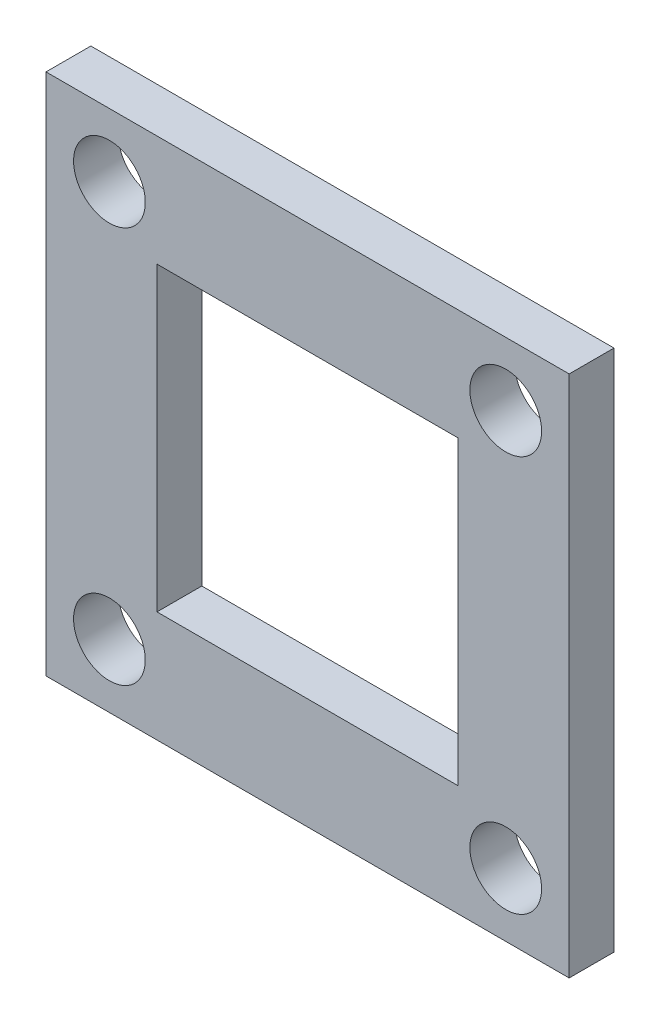
ISO-10303-21;
HEADER;
FILE_DESCRIPTION(('STEP AP214'),'2;1');
FILE_NAME('part.step','',(''),(''),'','','');
FILE_SCHEMA(('AUTOMOTIVE_DESIGN { 1 0 10303 214 1 1 1 1 }'));
ENDSEC;
DATA;
#1=APPLICATION_CONTEXT('core data for automotive mechanical design processes');
#2=APPLICATION_PROTOCOL_DEFINITION('international standard','automotive_design',2000,#1);
#3=PRODUCT_CONTEXT('',#1,'mechanical');
#4=PRODUCT('Part','Part','',(#3));
#5=PRODUCT_RELATED_PRODUCT_CATEGORY('part','',(#4));
#6=PRODUCT_DEFINITION_FORMATION('','',#4);
#7=PRODUCT_DEFINITION_CONTEXT('part definition',#1,'design');
#8=PRODUCT_DEFINITION('design','',#6,#7);
#9=PRODUCT_DEFINITION_SHAPE('','',#8);
#10=(LENGTH_UNIT() NAMED_UNIT(*) SI_UNIT(.MILLI.,.METRE.));
#11=(NAMED_UNIT(*) PLANE_ANGLE_UNIT() SI_UNIT($,.RADIAN.));
#12=(NAMED_UNIT(*) SI_UNIT($,.STERADIAN.) SOLID_ANGLE_UNIT());
#13=UNCERTAINTY_MEASURE_WITH_UNIT(LENGTH_MEASURE(1.E-05),#10,'distance_accuracy_value','');
#14=(GEOMETRIC_REPRESENTATION_CONTEXT(3) GLOBAL_UNCERTAINTY_ASSIGNED_CONTEXT((#13)) GLOBAL_UNIT_ASSIGNED_CONTEXT((#10,
#11,#12)) REPRESENTATION_CONTEXT('',''));
#15=CARTESIAN_POINT('',(0.,0.,0.));
#16=DIRECTION('',(0.,0.,1.));
#17=DIRECTION('',(1.,0.,0.));
#18=AXIS2_PLACEMENT_3D('',#15,#16,#17);
#19=CARTESIAN_POINT('',(0.,0.,1.));
#20=DIRECTION('',(0.,0.,-1.));
#21=DIRECTION('',(-1.,0.,0.));
#22=AXIS2_PLACEMENT_3D('',#19,#20,#21);
#23=PLANE('',#22);
#24=CARTESIAN_POINT('',(-8.83883476483186,8.83883476483183,1.));
#25=DIRECTION('',(0.,0.,-1.));
#26=DIRECTION('',(-1.,0.,0.));
#27=AXIS2_PLACEMENT_3D('',#24,#25,#26);
#28=CIRCLE('',#27,1.6);
#29=CARTESIAN_POINT('',(-10.4388347648319,8.83883476483183,1.));
#30=VERTEX_POINT('',#29);
#31=EDGE_CURVE('E247',#30,#30,#28,.T.);
#32=ORIENTED_EDGE('',*,*,#31,.T.);
#33=EDGE_LOOP('',(#32));
#34=FACE_BOUND('',#33,.T.);
#35=CARTESIAN_POINT('',(8.83883476483186,-8.83883476483183,1.));
#36=DIRECTION('',(0.,0.,-1.));
#37=DIRECTION('',(-1.,0.,0.));
#38=AXIS2_PLACEMENT_3D('',#35,#36,#37);
#39=CIRCLE('',#38,1.6);
#40=CARTESIAN_POINT('',(7.23883476483185,-8.83883476483183,1.));
#41=VERTEX_POINT('',#40);
#42=EDGE_CURVE('E253',#41,#41,#39,.T.);
#43=ORIENTED_EDGE('',*,*,#42,.T.);
#44=EDGE_LOOP('',(#43));
#45=FACE_BOUND('',#44,.T.);
#46=CARTESIAN_POINT('',(8.83883476483186,8.83883476483183,1.));
#47=DIRECTION('',(0.,0.,-1.));
#48=DIRECTION('',(-1.,0.,0.));
#49=AXIS2_PLACEMENT_3D('',#46,#47,#48);
#50=CIRCLE('',#49,1.6);
#51=CARTESIAN_POINT('',(7.23883476483185,8.83883476483183,1.));
#52=VERTEX_POINT('',#51);
#53=EDGE_CURVE('E238',#52,#52,#50,.T.);
#54=ORIENTED_EDGE('',*,*,#53,.T.);
#55=EDGE_LOOP('',(#54));
#56=FACE_BOUND('',#55,.T.);
#57=CARTESIAN_POINT('',(-8.83883476483186,-8.83883476483182,1.));
#58=DIRECTION('',(0.,0.,-1.));
#59=DIRECTION('',(-1.,0.,0.));
#60=AXIS2_PLACEMENT_3D('',#57,#58,#59);
#61=CIRCLE('',#60,1.6);
#62=CARTESIAN_POINT('',(-10.4388347648319,-8.83883476483182,1.));
#63=VERTEX_POINT('',#62);
#64=EDGE_CURVE('E128',#63,#63,#61,.T.);
#65=ORIENTED_EDGE('',*,*,#64,.T.);
#66=EDGE_LOOP('',(#65));
#67=FACE_BOUND('',#66,.T.);
#68=DIRECTION('',(0.,1.,0.));
#69=VECTOR('',#68,1.);
#70=CARTESIAN_POINT('',(11.667261889578,-11.667261889578,1.));
#71=LINE('',#70,#69);
#72=CARTESIAN_POINT('',(11.667261889578,-11.667261889578,1.));
#73=VERTEX_POINT('',#72);
#74=CARTESIAN_POINT('',(11.667261889578,11.667261889578,1.));
#75=VERTEX_POINT('',#74);
#76=EDGE_CURVE('E138',#73,#75,#71,.T.);
#77=ORIENTED_EDGE('',*,*,#76,.T.);
#78=DIRECTION('',(-1.,0.,0.));
#79=VECTOR('',#78,1.);
#80=CARTESIAN_POINT('',(-11.667261889578,11.667261889578,1.));
#81=LINE('',#80,#79);
#82=CARTESIAN_POINT('',(-11.667261889578,11.667261889578,1.));
#83=VERTEX_POINT('',#82);
#84=EDGE_CURVE('E141',#75,#83,#81,.T.);
#85=ORIENTED_EDGE('',*,*,#84,.T.);
#86=DIRECTION('',(0.,-1.,0.));
#87=VECTOR('',#86,1.);
#88=CARTESIAN_POINT('',(-11.667261889578,-11.667261889578,1.));
#89=LINE('',#88,#87);
#90=CARTESIAN_POINT('',(-11.667261889578,-11.667261889578,1.));
#91=VERTEX_POINT('',#90);
#92=EDGE_CURVE('E144',#83,#91,#89,.T.);
#93=ORIENTED_EDGE('',*,*,#92,.T.);
#94=DIRECTION('',(1.,0.,0.));
#95=VECTOR('',#94,1.);
#96=CARTESIAN_POINT('',(-11.667261889578,-11.667261889578,1.));
#97=LINE('',#96,#95);
#98=EDGE_CURVE('E146',#91,#73,#97,.T.);
#99=ORIENTED_EDGE('',*,*,#98,.T.);
#100=EDGE_LOOP('',(#77,#85,#93,#99));
#101=FACE_BOUND('',#100,.T.);
#102=DIRECTION('',(0.,1.,0.));
#103=VECTOR('',#102,1.);
#104=CARTESIAN_POINT('',(6.7175144212722,-6.7175144212722,1.));
#105=LINE('',#104,#103);
#106=CARTESIAN_POINT('',(6.7175144212722,-6.7175144212722,1.));
#107=VERTEX_POINT('',#106);
#108=CARTESIAN_POINT('',(6.7175144212722,6.7175144212722,1.));
#109=VERTEX_POINT('',#108);
#110=EDGE_CURVE('E100',#107,#109,#105,.T.);
#111=ORIENTED_EDGE('',*,*,#110,.F.);
#112=DIRECTION('',(1.,0.,0.));
#113=VECTOR('',#112,1.);
#114=CARTESIAN_POINT('',(-6.7175144212722,-6.7175144212722,1.));
#115=LINE('',#114,#113);
#116=CARTESIAN_POINT('',(-6.7175144212722,-6.7175144212722,1.));
#117=VERTEX_POINT('',#116);
#118=EDGE_CURVE('E122',#117,#107,#115,.T.);
#119=ORIENTED_EDGE('',*,*,#118,.F.);
#120=DIRECTION('',(0.,-1.,0.));
#121=VECTOR('',#120,1.);
#122=CARTESIAN_POINT('',(-6.7175144212722,-6.7175144212722,1.));
#123=LINE('',#122,#121);
#124=CARTESIAN_POINT('',(-6.7175144212722,6.7175144212722,1.));
#125=VERTEX_POINT('',#124);
#126=EDGE_CURVE('E120',#125,#117,#123,.T.);
#127=ORIENTED_EDGE('',*,*,#126,.F.);
#128=DIRECTION('',(-1.,0.,0.));
#129=VECTOR('',#128,1.);
#130=CARTESIAN_POINT('',(-6.7175144212722,6.7175144212722,1.));
#131=LINE('',#130,#129);
#132=EDGE_CURVE('E108',#109,#125,#131,.T.);
#133=ORIENTED_EDGE('',*,*,#132,.F.);
#134=EDGE_LOOP('',(#111,#119,#127,#133));
#135=FACE_BOUND('',#134,.T.);
#136=ADVANCED_FACE('F35',(#34,#45,#56,#67,#101,#135),#23,.F.);
#137=CARTESIAN_POINT('',(0.,0.,-1.));
#138=DIRECTION('',(0.,0.,-1.));
#139=DIRECTION('',(-1.,0.,0.));
#140=AXIS2_PLACEMENT_3D('',#137,#138,#139);
#141=PLANE('',#140);
#142=CARTESIAN_POINT('',(-8.83883476483186,8.83883476483183,-1.));
#143=DIRECTION('',(0.,0.,-1.));
#144=DIRECTION('',(-1.,0.,0.));
#145=AXIS2_PLACEMENT_3D('',#142,#143,#144);
#146=CIRCLE('',#145,1.6);
#147=CARTESIAN_POINT('',(-10.4388347648319,8.83883476483183,-1.));
#148=VERTEX_POINT('',#147);
#149=EDGE_CURVE('E250',#148,#148,#146,.T.);
#150=ORIENTED_EDGE('',*,*,#149,.F.);
#151=EDGE_LOOP('',(#150));
#152=FACE_BOUND('',#151,.T.);
#153=CARTESIAN_POINT('',(8.83883476483186,-8.83883476483183,-1.));
#154=DIRECTION('',(0.,0.,-1.));
#155=DIRECTION('',(-1.,0.,0.));
#156=AXIS2_PLACEMENT_3D('',#153,#154,#155);
#157=CIRCLE('',#156,1.6);
#158=CARTESIAN_POINT('',(7.23883476483185,-8.83883476483183,-1.));
#159=VERTEX_POINT('',#158);
#160=EDGE_CURVE('E244',#159,#159,#157,.T.);
#161=ORIENTED_EDGE('',*,*,#160,.F.);
#162=EDGE_LOOP('',(#161));
#163=FACE_BOUND('',#162,.T.);
#164=CARTESIAN_POINT('',(8.83883476483186,8.83883476483183,-1.));
#165=DIRECTION('',(0.,0.,-1.));
#166=DIRECTION('',(-1.,0.,0.));
#167=AXIS2_PLACEMENT_3D('',#164,#165,#166);
#168=CIRCLE('',#167,1.6);
#169=CARTESIAN_POINT('',(7.23883476483185,8.83883476483183,-1.));
#170=VERTEX_POINT('',#169);
#171=EDGE_CURVE('E241',#170,#170,#168,.T.);
#172=ORIENTED_EDGE('',*,*,#171,.F.);
#173=EDGE_LOOP('',(#172));
#174=FACE_BOUND('',#173,.T.);
#175=CARTESIAN_POINT('',(-8.83883476483186,-8.83883476483182,-1.));
#176=DIRECTION('',(0.,0.,-1.));
#177=DIRECTION('',(-1.,0.,0.));
#178=AXIS2_PLACEMENT_3D('',#175,#176,#177);
#179=CIRCLE('',#178,1.6);
#180=CARTESIAN_POINT('',(-10.4388347648319,-8.83883476483182,-1.));
#181=VERTEX_POINT('',#180);
#182=EDGE_CURVE('E249',#181,#181,#179,.T.);
#183=ORIENTED_EDGE('',*,*,#182,.F.);
#184=EDGE_LOOP('',(#183));
#185=FACE_BOUND('',#184,.T.);
#186=DIRECTION('',(0.,1.,0.));
#187=VECTOR('',#186,1.);
#188=CARTESIAN_POINT('',(11.667261889578,-11.667261889578,-1.));
#189=LINE('',#188,#187);
#190=CARTESIAN_POINT('',(11.667261889578,-11.667261889578,-1.));
#191=VERTEX_POINT('',#190);
#192=CARTESIAN_POINT('',(11.667261889578,11.667261889578,-1.));
#193=VERTEX_POINT('',#192);
#194=EDGE_CURVE('E116',#191,#193,#189,.T.);
#195=ORIENTED_EDGE('',*,*,#194,.F.);
#196=DIRECTION('',(1.,0.,0.));
#197=VECTOR('',#196,1.);
#198=CARTESIAN_POINT('',(-11.667261889578,-11.667261889578,-1.));
#199=LINE('',#198,#197);
#200=CARTESIAN_POINT('',(-11.667261889578,-11.667261889578,-1.));
#201=VERTEX_POINT('',#200);
#202=EDGE_CURVE('E142',#201,#191,#199,.T.);
#203=ORIENTED_EDGE('',*,*,#202,.F.);
#204=DIRECTION('',(0.,-1.,0.));
#205=VECTOR('',#204,1.);
#206=CARTESIAN_POINT('',(-11.667261889578,-11.667261889578,-1.));
#207=LINE('',#206,#205);
#208=CARTESIAN_POINT('',(-11.667261889578,11.667261889578,-1.));
#209=VERTEX_POINT('',#208);
#210=EDGE_CURVE('E153',#209,#201,#207,.T.);
#211=ORIENTED_EDGE('',*,*,#210,.F.);
#212=DIRECTION('',(-1.,0.,0.));
#213=VECTOR('',#212,1.);
#214=CARTESIAN_POINT('',(-11.667261889578,11.667261889578,-1.));
#215=LINE('',#214,#213);
#216=EDGE_CURVE('E151',#193,#209,#215,.T.);
#217=ORIENTED_EDGE('',*,*,#216,.F.);
#218=EDGE_LOOP('',(#195,#203,#211,#217));
#219=FACE_BOUND('',#218,.T.);
#220=DIRECTION('',(1.,0.,0.));
#221=VECTOR('',#220,1.);
#222=CARTESIAN_POINT('',(-6.7175144212722,-6.7175144212722,-1.));
#223=LINE('',#222,#221);
#224=CARTESIAN_POINT('',(-6.7175144212722,-6.7175144212722,-1.));
#225=VERTEX_POINT('',#224);
#226=CARTESIAN_POINT('',(6.7175144212722,-6.7175144212722,-1.));
#227=VERTEX_POINT('',#226);
#228=EDGE_CURVE('E109',#225,#227,#223,.T.);
#229=ORIENTED_EDGE('',*,*,#228,.T.);
#230=DIRECTION('',(0.,1.,0.));
#231=VECTOR('',#230,1.);
#232=CARTESIAN_POINT('',(6.7175144212722,-6.7175144212722,-1.));
#233=LINE('',#232,#231);
#234=CARTESIAN_POINT('',(6.7175144212722,6.7175144212722,-1.));
#235=VERTEX_POINT('',#234);
#236=EDGE_CURVE('E58',#227,#235,#233,.T.);
#237=ORIENTED_EDGE('',*,*,#236,.T.);
#238=DIRECTION('',(-1.,0.,0.));
#239=VECTOR('',#238,1.);
#240=CARTESIAN_POINT('',(-6.7175144212722,6.7175144212722,-1.));
#241=LINE('',#240,#239);
#242=CARTESIAN_POINT('',(-6.7175144212722,6.7175144212722,-1.));
#243=VERTEX_POINT('',#242);
#244=EDGE_CURVE('E115',#235,#243,#241,.T.);
#245=ORIENTED_EDGE('',*,*,#244,.T.);
#246=DIRECTION('',(0.,-1.,0.));
#247=VECTOR('',#246,1.);
#248=CARTESIAN_POINT('',(-6.7175144212722,-6.7175144212722,-1.));
#249=LINE('',#248,#247);
#250=EDGE_CURVE('E130',#243,#225,#249,.T.);
#251=ORIENTED_EDGE('',*,*,#250,.T.);
#252=EDGE_LOOP('',(#229,#237,#245,#251));
#253=FACE_BOUND('',#252,.T.);
#254=ADVANCED_FACE('F171',(#152,#163,#174,#185,#219,#253),#141,.T.);
#255=CARTESIAN_POINT('',(11.667261889578,-11.667261889578,1.));
#256=DIRECTION('',(-1.,0.,0.));
#257=DIRECTION('',(0.,0.,1.));
#258=AXIS2_PLACEMENT_3D('',#255,#256,#257);
#259=PLANE('',#258);
#260=ORIENTED_EDGE('',*,*,#194,.T.);
#261=DIRECTION('',(0.,0.,-1.));
#262=VECTOR('',#261,1.);
#263=CARTESIAN_POINT('',(11.667261889578,11.667261889578,1.));
#264=LINE('',#263,#262);
#265=EDGE_CURVE('E11',#75,#193,#264,.T.);
#266=ORIENTED_EDGE('',*,*,#265,.F.);
#267=ORIENTED_EDGE('',*,*,#76,.F.);
#268=DIRECTION('',(0.,0.,-1.));
#269=VECTOR('',#268,1.);
#270=CARTESIAN_POINT('',(11.667261889578,-11.667261889578,1.));
#271=LINE('',#270,#269);
#272=EDGE_CURVE('E148',#73,#191,#271,.T.);
#273=ORIENTED_EDGE('',*,*,#272,.T.);
#274=EDGE_LOOP('',(#260,#266,#267,#273));
#275=FACE_BOUND('',#274,.T.);
#276=ADVANCED_FACE('F37',(#275),#259,.F.);
#277=CARTESIAN_POINT('',(-11.667261889578,11.667261889578,1.));
#278=DIRECTION('',(0.,-1.,0.));
#279=DIRECTION('',(0.,0.,-1.));
#280=AXIS2_PLACEMENT_3D('',#277,#278,#279);
#281=PLANE('',#280);
#282=ORIENTED_EDGE('',*,*,#216,.T.);
#283=DIRECTION('',(0.,0.,-1.));
#284=VECTOR('',#283,1.);
#285=CARTESIAN_POINT('',(-11.667261889578,11.667261889578,1.));
#286=LINE('',#285,#284);
#287=EDGE_CURVE('E43',#83,#209,#286,.T.);
#288=ORIENTED_EDGE('',*,*,#287,.F.);
#289=ORIENTED_EDGE('',*,*,#84,.F.);
#290=ORIENTED_EDGE('',*,*,#265,.T.);
#291=EDGE_LOOP('',(#282,#288,#289,#290));
#292=FACE_BOUND('',#291,.T.);
#293=ADVANCED_FACE('F181',(#292),#281,.F.);
#294=CARTESIAN_POINT('',(-11.667261889578,-11.667261889578,1.));
#295=DIRECTION('',(1.,0.,0.));
#296=DIRECTION('',(0.,0.,-1.));
#297=AXIS2_PLACEMENT_3D('',#294,#295,#296);
#298=PLANE('',#297);
#299=ORIENTED_EDGE('',*,*,#210,.T.);
#300=DIRECTION('',(0.,0.,-1.));
#301=VECTOR('',#300,1.);
#302=CARTESIAN_POINT('',(-11.667261889578,-11.667261889578,1.));
#303=LINE('',#302,#301);
#304=EDGE_CURVE('E158',#91,#201,#303,.T.);
#305=ORIENTED_EDGE('',*,*,#304,.F.);
#306=ORIENTED_EDGE('',*,*,#92,.F.);
#307=ORIENTED_EDGE('',*,*,#287,.T.);
#308=EDGE_LOOP('',(#299,#305,#306,#307));
#309=FACE_BOUND('',#308,.T.);
#310=ADVANCED_FACE('F165',(#309),#298,.F.);
#311=CARTESIAN_POINT('',(-11.667261889578,-11.667261889578,1.));
#312=DIRECTION('',(0.,1.,0.));
#313=DIRECTION('',(0.,0.,1.));
#314=AXIS2_PLACEMENT_3D('',#311,#312,#313);
#315=PLANE('',#314);
#316=ORIENTED_EDGE('',*,*,#202,.T.);
#317=ORIENTED_EDGE('',*,*,#272,.F.);
#318=ORIENTED_EDGE('',*,*,#98,.F.);
#319=ORIENTED_EDGE('',*,*,#304,.T.);
#320=EDGE_LOOP('',(#316,#317,#318,#319));
#321=FACE_BOUND('',#320,.T.);
#322=ADVANCED_FACE('F175',(#321),#315,.F.);
#323=CARTESIAN_POINT('',(6.7175144212722,-6.7175144212722,1.));
#324=DIRECTION('',(-1.,0.,0.));
#325=DIRECTION('',(0.,0.,1.));
#326=AXIS2_PLACEMENT_3D('',#323,#324,#325);
#327=PLANE('',#326);
#328=ORIENTED_EDGE('',*,*,#236,.F.);
#329=DIRECTION('',(0.,0.,-1.));
#330=VECTOR('',#329,1.);
#331=CARTESIAN_POINT('',(6.7175144212722,-6.7175144212722,1.));
#332=LINE('',#331,#330);
#333=EDGE_CURVE('E104',#107,#227,#332,.T.);
#334=ORIENTED_EDGE('',*,*,#333,.F.);
#335=ORIENTED_EDGE('',*,*,#110,.T.);
#336=DIRECTION('',(0.,0.,-1.));
#337=VECTOR('',#336,1.);
#338=CARTESIAN_POINT('',(6.7175144212722,6.7175144212722,1.));
#339=LINE('',#338,#337);
#340=EDGE_CURVE('E103',#109,#235,#339,.T.);
#341=ORIENTED_EDGE('',*,*,#340,.T.);
#342=EDGE_LOOP('',(#328,#334,#335,#341));
#343=FACE_BOUND('',#342,.T.);
#344=ADVANCED_FACE('F102',(#343),#327,.T.);
#345=CARTESIAN_POINT('',(-6.7175144212722,6.7175144212722,1.));
#346=DIRECTION('',(0.,-1.,0.));
#347=DIRECTION('',(0.,0.,-1.));
#348=AXIS2_PLACEMENT_3D('',#345,#346,#347);
#349=PLANE('',#348);
#350=ORIENTED_EDGE('',*,*,#244,.F.);
#351=ORIENTED_EDGE('',*,*,#340,.F.);
#352=ORIENTED_EDGE('',*,*,#132,.T.);
#353=DIRECTION('',(0.,0.,-1.));
#354=VECTOR('',#353,1.);
#355=CARTESIAN_POINT('',(-6.7175144212722,6.7175144212722,1.));
#356=LINE('',#355,#354);
#357=EDGE_CURVE('E117',#125,#243,#356,.T.);
#358=ORIENTED_EDGE('',*,*,#357,.T.);
#359=EDGE_LOOP('',(#350,#351,#352,#358));
#360=FACE_BOUND('',#359,.T.);
#361=ADVANCED_FACE('F112',(#360),#349,.T.);
#362=CARTESIAN_POINT('',(-6.7175144212722,-6.7175144212722,1.));
#363=DIRECTION('',(1.,0.,0.));
#364=DIRECTION('',(0.,0.,-1.));
#365=AXIS2_PLACEMENT_3D('',#362,#363,#364);
#366=PLANE('',#365);
#367=ORIENTED_EDGE('',*,*,#250,.F.);
#368=ORIENTED_EDGE('',*,*,#357,.F.);
#369=ORIENTED_EDGE('',*,*,#126,.T.);
#370=DIRECTION('',(0.,0.,-1.));
#371=VECTOR('',#370,1.);
#372=CARTESIAN_POINT('',(-6.7175144212722,-6.7175144212722,1.));
#373=LINE('',#372,#371);
#374=EDGE_CURVE('E50',#117,#225,#373,.T.);
#375=ORIENTED_EDGE('',*,*,#374,.T.);
#376=EDGE_LOOP('',(#367,#368,#369,#375));
#377=FACE_BOUND('',#376,.T.);
#378=ADVANCED_FACE('F208',(#377),#366,.T.);
#379=CARTESIAN_POINT('',(-6.7175144212722,-6.7175144212722,1.));
#380=DIRECTION('',(0.,1.,0.));
#381=DIRECTION('',(0.,0.,1.));
#382=AXIS2_PLACEMENT_3D('',#379,#380,#381);
#383=PLANE('',#382);
#384=ORIENTED_EDGE('',*,*,#228,.F.);
#385=ORIENTED_EDGE('',*,*,#374,.F.);
#386=ORIENTED_EDGE('',*,*,#118,.T.);
#387=ORIENTED_EDGE('',*,*,#333,.T.);
#388=EDGE_LOOP('',(#384,#385,#386,#387));
#389=FACE_BOUND('',#388,.T.);
#390=ADVANCED_FACE('F212',(#389),#383,.T.);
#391=CARTESIAN_POINT('',(-8.83883476483186,-8.83883476483182,1.));
#392=DIRECTION('',(0.,0.,-1.));
#393=DIRECTION('',(-1.,0.,0.));
#394=AXIS2_PLACEMENT_3D('',#391,#392,#393);
#395=CYLINDRICAL_SURFACE('',#394,1.6);
#396=ORIENTED_EDGE('',*,*,#64,.F.);
#397=EDGE_LOOP('',(#396));
#398=FACE_BOUND('',#397,.T.);
#399=ORIENTED_EDGE('',*,*,#182,.T.);
#400=EDGE_LOOP('',(#399));
#401=FACE_BOUND('',#400,.T.);
#402=ADVANCED_FACE('F218',(#398,#401),#395,.F.);
#403=CARTESIAN_POINT('',(8.83883476483186,8.83883476483183,1.));
#404=DIRECTION('',(0.,0.,-1.));
#405=DIRECTION('',(-1.,0.,0.));
#406=AXIS2_PLACEMENT_3D('',#403,#404,#405);
#407=CYLINDRICAL_SURFACE('',#406,1.6);
#408=ORIENTED_EDGE('',*,*,#53,.F.);
#409=EDGE_LOOP('',(#408));
#410=FACE_BOUND('',#409,.T.);
#411=ORIENTED_EDGE('',*,*,#171,.T.);
#412=EDGE_LOOP('',(#411));
#413=FACE_BOUND('',#412,.T.);
#414=ADVANCED_FACE('F221',(#410,#413),#407,.F.);
#415=CARTESIAN_POINT('',(8.83883476483186,-8.83883476483183,1.));
#416=DIRECTION('',(0.,0.,-1.));
#417=DIRECTION('',(-1.,0.,0.));
#418=AXIS2_PLACEMENT_3D('',#415,#416,#417);
#419=CYLINDRICAL_SURFACE('',#418,1.6);
#420=ORIENTED_EDGE('',*,*,#42,.F.);
#421=EDGE_LOOP('',(#420));
#422=FACE_BOUND('',#421,.T.);
#423=ORIENTED_EDGE('',*,*,#160,.T.);
#424=EDGE_LOOP('',(#423));
#425=FACE_BOUND('',#424,.T.);
#426=ADVANCED_FACE('F223',(#422,#425),#419,.F.);
#427=CARTESIAN_POINT('',(-8.83883476483186,8.83883476483183,1.));
#428=DIRECTION('',(0.,0.,-1.));
#429=DIRECTION('',(-1.,0.,0.));
#430=AXIS2_PLACEMENT_3D('',#427,#428,#429);
#431=CYLINDRICAL_SURFACE('',#430,1.6);
#432=ORIENTED_EDGE('',*,*,#31,.F.);
#433=EDGE_LOOP('',(#432));
#434=FACE_BOUND('',#433,.T.);
#435=ORIENTED_EDGE('',*,*,#149,.T.);
#436=EDGE_LOOP('',(#435));
#437=FACE_BOUND('',#436,.T.);
#438=ADVANCED_FACE('F226',(#434,#437),#431,.F.);
#439=CLOSED_SHELL('',(#136,#254,#276,#293,#310,#322,#344,#361,#378,#390,#402,#414,#426,#438));
#440=MANIFOLD_SOLID_BREP('B2',#439);
#441=ADVANCED_BREP_SHAPE_REPRESENTATION('',(#18,#440),#14);
#442=SHAPE_DEFINITION_REPRESENTATION(#9,#441);
ENDSEC;
END-ISO-10303-21;
